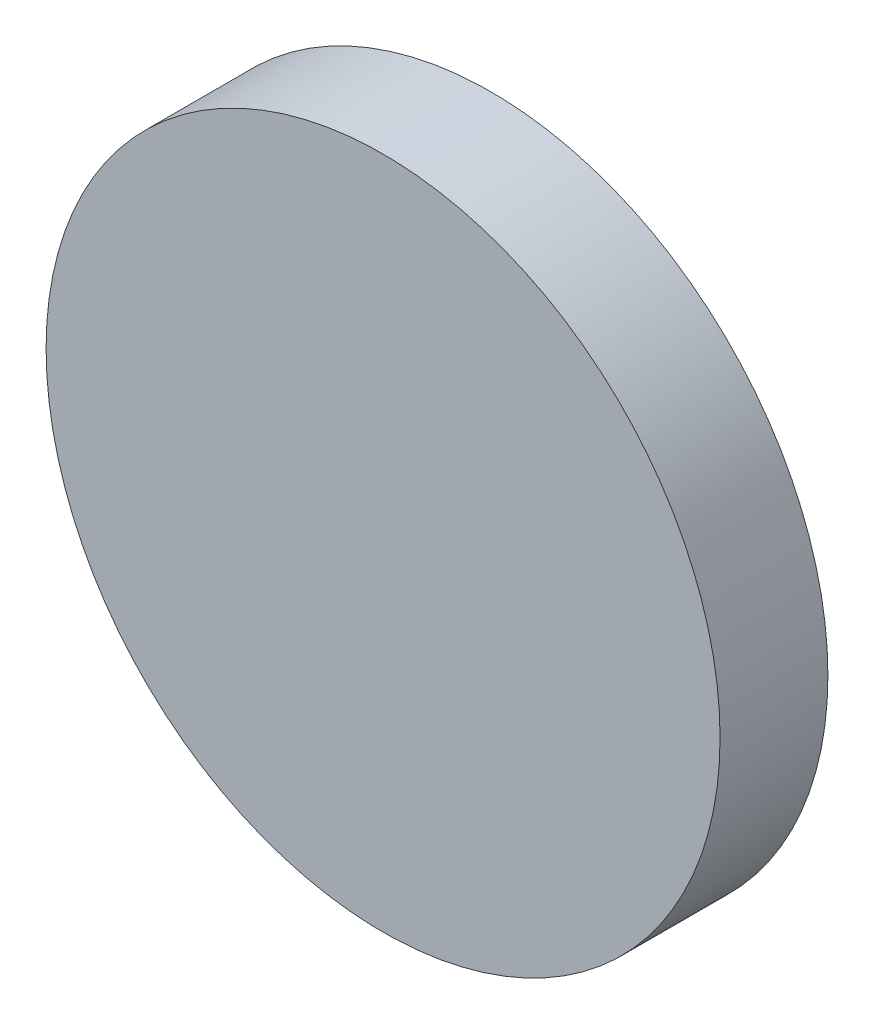
ISO-10303-21;
HEADER;
FILE_DESCRIPTION(('STEP AP214'),'2;1');
FILE_NAME('part.step','',(''),(''),'','','');
FILE_SCHEMA(('AUTOMOTIVE_DESIGN { 1 0 10303 214 1 1 1 1 }'));
ENDSEC;
DATA;
#1=APPLICATION_CONTEXT('core data for automotive mechanical design processes');
#2=APPLICATION_PROTOCOL_DEFINITION('international standard','automotive_design',2000,#1);
#3=PRODUCT_CONTEXT('',#1,'mechanical');
#4=PRODUCT('Part','Part','',(#3));
#5=PRODUCT_RELATED_PRODUCT_CATEGORY('part','',(#4));
#6=PRODUCT_DEFINITION_FORMATION('','',#4);
#7=PRODUCT_DEFINITION_CONTEXT('part definition',#1,'design');
#8=PRODUCT_DEFINITION('design','',#6,#7);
#9=PRODUCT_DEFINITION_SHAPE('','',#8);
#10=(LENGTH_UNIT() NAMED_UNIT(*) SI_UNIT(.MILLI.,.METRE.));
#11=(NAMED_UNIT(*) PLANE_ANGLE_UNIT() SI_UNIT($,.RADIAN.));
#12=(NAMED_UNIT(*) SI_UNIT($,.STERADIAN.) SOLID_ANGLE_UNIT());
#13=UNCERTAINTY_MEASURE_WITH_UNIT(LENGTH_MEASURE(1.E-05),#10,'distance_accuracy_value','');
#14=(GEOMETRIC_REPRESENTATION_CONTEXT(3) GLOBAL_UNCERTAINTY_ASSIGNED_CONTEXT((#13)) GLOBAL_UNIT_ASSIGNED_CONTEXT((#10,
#11,#12)) REPRESENTATION_CONTEXT('',''));
#15=CARTESIAN_POINT('',(0.,0.,0.));
#16=DIRECTION('',(0.,0.,1.));
#17=DIRECTION('',(1.,0.,0.));
#18=AXIS2_PLACEMENT_3D('',#15,#16,#17);
#19=CARTESIAN_POINT('',(0.,0.,4.));
#20=DIRECTION('',(0.,0.,-1.));
#21=DIRECTION('',(-1.,0.,0.));
#22=AXIS2_PLACEMENT_3D('',#19,#20,#21);
#23=CYLINDRICAL_SURFACE('',#22,12.5);
#24=CARTESIAN_POINT('',(0.,0.,4.));
#25=DIRECTION('',(0.,0.,1.));
#26=DIRECTION('',(1.,0.,0.));
#27=AXIS2_PLACEMENT_3D('',#24,#25,#26);
#28=CIRCLE('',#27,12.5);
#29=CARTESIAN_POINT('',(12.5,0.,4.));
#30=VERTEX_POINT('',#29);
#31=EDGE_CURVE('E10',#30,#30,#28,.T.);
#32=ORIENTED_EDGE('',*,*,#31,.F.);
#33=EDGE_LOOP('',(#32));
#34=FACE_BOUND('',#33,.T.);
#35=CARTESIAN_POINT('',(0.,0.,0.));
#36=DIRECTION('',(0.,0.,1.));
#37=DIRECTION('',(1.,0.,0.));
#38=AXIS2_PLACEMENT_3D('',#35,#36,#37);
#39=CIRCLE('',#38,12.5);
#40=CARTESIAN_POINT('',(12.5,0.,0.));
#41=VERTEX_POINT('',#40);
#42=EDGE_CURVE('E38',#41,#41,#39,.T.);
#43=ORIENTED_EDGE('',*,*,#42,.T.);
#44=EDGE_LOOP('',(#43));
#45=FACE_BOUND('',#44,.T.);
#46=ADVANCED_FACE('F35',(#34,#45),#23,.T.);
#47=CARTESIAN_POINT('',(0.,0.,4.));
#48=DIRECTION('',(0.,0.,1.));
#49=DIRECTION('',(1.,0.,0.));
#50=AXIS2_PLACEMENT_3D('',#47,#48,#49);
#51=PLANE('',#50);
#52=ORIENTED_EDGE('',*,*,#31,.T.);
#53=EDGE_LOOP('',(#52));
#54=FACE_BOUND('',#53,.T.);
#55=ADVANCED_FACE('F50',(#54),#51,.T.);
#56=CARTESIAN_POINT('',(0.,0.,0.));
#57=DIRECTION('',(0.,0.,1.));
#58=DIRECTION('',(1.,0.,0.));
#59=AXIS2_PLACEMENT_3D('',#56,#57,#58);
#60=PLANE('',#59);
#61=ORIENTED_EDGE('',*,*,#42,.F.);
#62=EDGE_LOOP('',(#61));
#63=FACE_BOUND('',#62,.T.);
#64=ADVANCED_FACE('F48',(#63),#60,.F.);
#65=CLOSED_SHELL('',(#46,#55,#64));
#66=MANIFOLD_SOLID_BREP('B2',#65);
#67=ADVANCED_BREP_SHAPE_REPRESENTATION('',(#18,#66),#14);
#68=SHAPE_DEFINITION_REPRESENTATION(#9,#67);
ENDSEC;
END-ISO-10303-21;
